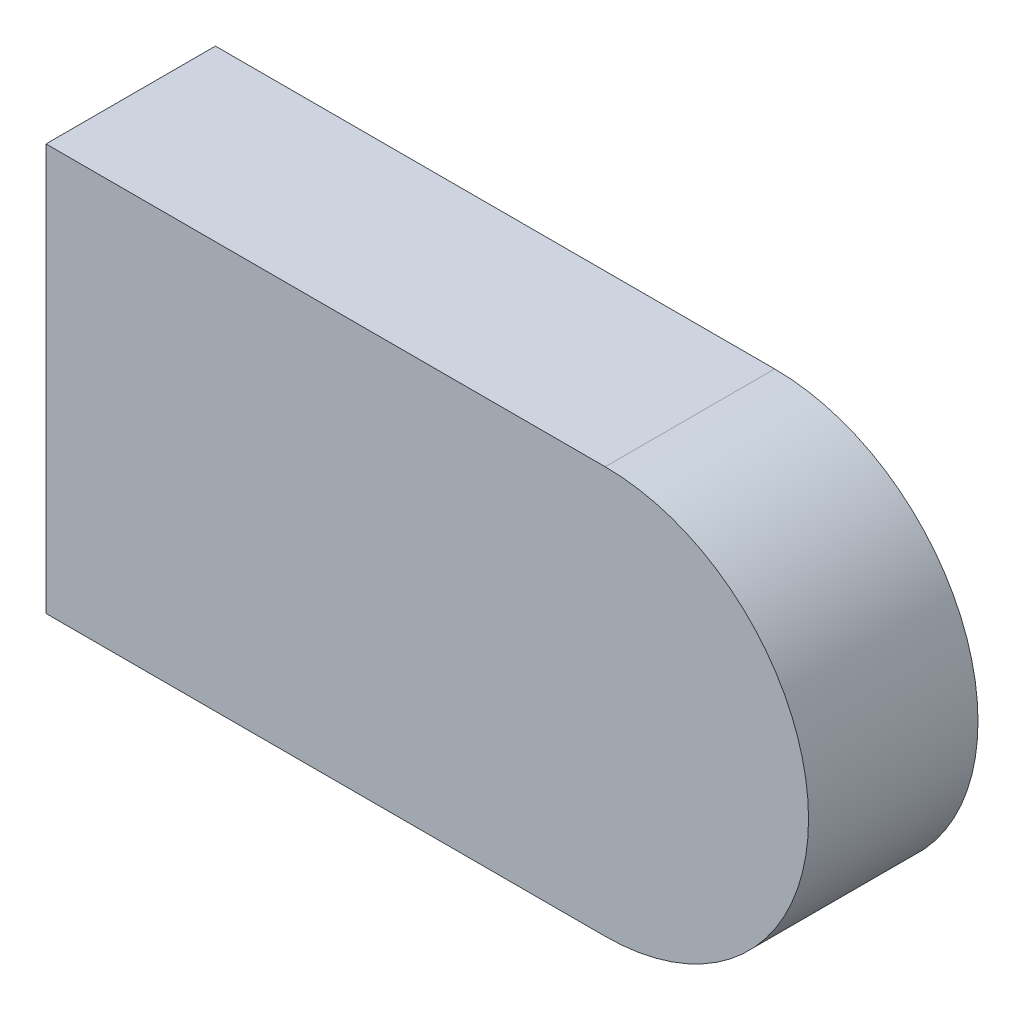
ISO-10303-21;
HEADER;
FILE_DESCRIPTION(('STEP AP214'),'2;1');
FILE_NAME('part.step','',(''),(''),'','','');
FILE_SCHEMA(('AUTOMOTIVE_DESIGN { 1 0 10303 214 1 1 1 1 }'));
ENDSEC;
DATA;
#1=APPLICATION_CONTEXT('core data for automotive mechanical design processes');
#2=APPLICATION_PROTOCOL_DEFINITION('international standard','automotive_design',2000,#1);
#3=PRODUCT_CONTEXT('',#1,'mechanical');
#4=PRODUCT('Part','Part','',(#3));
#5=PRODUCT_RELATED_PRODUCT_CATEGORY('part','',(#4));
#6=PRODUCT_DEFINITION_FORMATION('','',#4);
#7=PRODUCT_DEFINITION_CONTEXT('part definition',#1,'design');
#8=PRODUCT_DEFINITION('design','',#6,#7);
#9=PRODUCT_DEFINITION_SHAPE('','',#8);
#10=(LENGTH_UNIT() NAMED_UNIT(*) SI_UNIT(.MILLI.,.METRE.));
#11=(NAMED_UNIT(*) PLANE_ANGLE_UNIT() SI_UNIT($,.RADIAN.));
#12=(NAMED_UNIT(*) SI_UNIT($,.STERADIAN.) SOLID_ANGLE_UNIT());
#13=UNCERTAINTY_MEASURE_WITH_UNIT(LENGTH_MEASURE(1.E-05),#10,'distance_accuracy_value','');
#14=(GEOMETRIC_REPRESENTATION_CONTEXT(3) GLOBAL_UNCERTAINTY_ASSIGNED_CONTEXT((#13)) GLOBAL_UNIT_ASSIGNED_CONTEXT((#10,
#11,#12)) REPRESENTATION_CONTEXT('',''));
#15=CARTESIAN_POINT('',(0.,0.,0.));
#16=DIRECTION('',(0.,0.,1.));
#17=DIRECTION('',(1.,0.,0.));
#18=AXIS2_PLACEMENT_3D('',#15,#16,#17);
#19=CARTESIAN_POINT('',(-4.05,-1.37,0.));
#20=DIRECTION('',(0.,1.,0.));
#21=DIRECTION('',(1.,0.,0.));
#22=AXIS2_PLACEMENT_3D('',#19,#20,#21);
#23=PLANE('',#22);
#24=DIRECTION('',(1.,0.,0.));
#25=VECTOR('',#24,1.);
#26=CARTESIAN_POINT('',(-4.05,-1.37,0.));
#27=LINE('',#26,#25);
#28=CARTESIAN_POINT('',(-4.05,-1.37,0.));
#29=VERTEX_POINT('',#28);
#30=CARTESIAN_POINT('',(-3.72,-1.37,0.));
#31=VERTEX_POINT('',#30);
#32=EDGE_CURVE('E11',#29,#31,#27,.T.);
#33=ORIENTED_EDGE('',*,*,#32,.T.);
#34=DIRECTION('',(0.,0.,1.));
#35=VECTOR('',#34,1.);
#36=CARTESIAN_POINT('',(-3.72,-1.37,0.));
#37=LINE('',#36,#35);
#38=CARTESIAN_POINT('',(-3.72,-1.37,0.1));
#39=VERTEX_POINT('',#38);
#40=EDGE_CURVE('E24',#31,#39,#37,.T.);
#41=ORIENTED_EDGE('',*,*,#40,.T.);
#42=DIRECTION('',(1.,0.,0.));
#43=VECTOR('',#42,1.);
#44=CARTESIAN_POINT('',(-4.05,-1.37,0.1));
#45=LINE('',#44,#43);
#46=CARTESIAN_POINT('',(-4.05,-1.37,0.1));
#47=VERTEX_POINT('',#46);
#48=EDGE_CURVE('E88',#47,#39,#45,.T.);
#49=ORIENTED_EDGE('',*,*,#48,.F.);
#50=DIRECTION('',(0.,0.,1.));
#51=VECTOR('',#50,1.);
#52=CARTESIAN_POINT('',(-4.05,-1.37,0.));
#53=LINE('',#52,#51);
#54=EDGE_CURVE('E36',#29,#47,#53,.T.);
#55=ORIENTED_EDGE('',*,*,#54,.F.);
#56=EDGE_LOOP('',(#33,#41,#49,#55));
#57=FACE_BOUND('',#56,.T.);
#58=ADVANCED_FACE('F17',(#57),#23,.F.);
#59=CARTESIAN_POINT('',(-3.72,-1.25,0.));
#60=DIRECTION('',(0.,0.,-1.));
#61=DIRECTION('',(1.,0.,0.));
#62=AXIS2_PLACEMENT_3D('',#59,#60,#61);
#63=CYLINDRICAL_SURFACE('',#62,0.12);
#64=CARTESIAN_POINT('',(-3.72,-1.25,0.));
#65=DIRECTION('',(0.,0.,1.));
#66=DIRECTION('',(1.,0.,0.));
#67=AXIS2_PLACEMENT_3D('',#64,#65,#66);
#68=CIRCLE('',#67,0.12);
#69=CARTESIAN_POINT('',(-3.72,-1.13,0.));
#70=VERTEX_POINT('',#69);
#71=EDGE_CURVE('E85',#31,#70,#68,.T.);
#72=ORIENTED_EDGE('',*,*,#71,.T.);
#73=DIRECTION('',(0.,0.,1.));
#74=VECTOR('',#73,1.);
#75=CARTESIAN_POINT('',(-3.72,-1.13,0.));
#76=LINE('',#75,#74);
#77=CARTESIAN_POINT('',(-3.72,-1.13,0.1));
#78=VERTEX_POINT('',#77);
#79=EDGE_CURVE('E73',#70,#78,#76,.T.);
#80=ORIENTED_EDGE('',*,*,#79,.T.);
#81=CARTESIAN_POINT('',(-3.72,-1.25,0.1));
#82=DIRECTION('',(0.,0.,1.));
#83=DIRECTION('',(1.,0.,0.));
#84=AXIS2_PLACEMENT_3D('',#81,#82,#83);
#85=CIRCLE('',#84,0.12);
#86=EDGE_CURVE('E66',#39,#78,#85,.T.);
#87=ORIENTED_EDGE('',*,*,#86,.F.);
#88=ORIENTED_EDGE('',*,*,#40,.F.);
#89=EDGE_LOOP('',(#72,#80,#87,#88));
#90=FACE_BOUND('',#89,.T.);
#91=ADVANCED_FACE('F89',(#90),#63,.T.);
#92=CARTESIAN_POINT('',(-4.05,-1.13,0.));
#93=DIRECTION('',(0.,1.,0.));
#94=DIRECTION('',(1.,0.,0.));
#95=AXIS2_PLACEMENT_3D('',#92,#93,#94);
#96=PLANE('',#95);
#97=DIRECTION('',(0.,0.,1.));
#98=VECTOR('',#97,1.);
#99=CARTESIAN_POINT('',(-4.05,-1.13,0.));
#100=LINE('',#99,#98);
#101=CARTESIAN_POINT('',(-4.05,-1.13,0.));
#102=VERTEX_POINT('',#101);
#103=CARTESIAN_POINT('',(-4.05,-1.13,0.1));
#104=VERTEX_POINT('',#103);
#105=EDGE_CURVE('E56',#102,#104,#100,.T.);
#106=ORIENTED_EDGE('',*,*,#105,.T.);
#107=DIRECTION('',(1.,0.,0.));
#108=VECTOR('',#107,1.);
#109=CARTESIAN_POINT('',(-4.05,-1.13,0.1));
#110=LINE('',#109,#108);
#111=EDGE_CURVE('E67',#104,#78,#110,.T.);
#112=ORIENTED_EDGE('',*,*,#111,.T.);
#113=ORIENTED_EDGE('',*,*,#79,.F.);
#114=DIRECTION('',(1.,0.,0.));
#115=VECTOR('',#114,1.);
#116=CARTESIAN_POINT('',(-4.05,-1.13,0.));
#117=LINE('',#116,#115);
#118=EDGE_CURVE('E71',#102,#70,#117,.T.);
#119=ORIENTED_EDGE('',*,*,#118,.F.);
#120=EDGE_LOOP('',(#106,#112,#113,#119));
#121=FACE_BOUND('',#120,.T.);
#122=ADVANCED_FACE('F72',(#121),#96,.T.);
#123=CARTESIAN_POINT('',(-4.05,-1.37,0.));
#124=DIRECTION('',(-1.,0.,0.));
#125=DIRECTION('',(0.,1.,0.));
#126=AXIS2_PLACEMENT_3D('',#123,#124,#125);
#127=PLANE('',#126);
#128=ORIENTED_EDGE('',*,*,#54,.T.);
#129=DIRECTION('',(0.,1.,0.));
#130=VECTOR('',#129,1.);
#131=CARTESIAN_POINT('',(-4.05,-1.37,0.1));
#132=LINE('',#131,#130);
#133=EDGE_CURVE('E62',#47,#104,#132,.T.);
#134=ORIENTED_EDGE('',*,*,#133,.T.);
#135=ORIENTED_EDGE('',*,*,#105,.F.);
#136=DIRECTION('',(0.,1.,0.));
#137=VECTOR('',#136,1.);
#138=CARTESIAN_POINT('',(-4.05,-1.37,0.));
#139=LINE('',#138,#137);
#140=EDGE_CURVE('E60',#29,#102,#139,.T.);
#141=ORIENTED_EDGE('',*,*,#140,.F.);
#142=EDGE_LOOP('',(#128,#134,#135,#141));
#143=FACE_BOUND('',#142,.T.);
#144=ADVANCED_FACE('F58',(#143),#127,.T.);
#145=CARTESIAN_POINT('',(-3.849490847913,-1.25,0.));
#146=DIRECTION('',(0.,0.,1.));
#147=DIRECTION('',(1.,0.,0.));
#148=AXIS2_PLACEMENT_3D('',#145,#146,#147);
#149=PLANE('',#148);
#150=ORIENTED_EDGE('',*,*,#140,.T.);
#151=ORIENTED_EDGE('',*,*,#118,.T.);
#152=ORIENTED_EDGE('',*,*,#71,.F.);
#153=ORIENTED_EDGE('',*,*,#32,.F.);
#154=EDGE_LOOP('',(#150,#151,#152,#153));
#155=FACE_BOUND('',#154,.T.);
#156=ADVANCED_FACE('F77',(#155),#149,.F.);
#157=CARTESIAN_POINT('',(-3.849490847913,-1.25,0.1));
#158=DIRECTION('',(0.,0.,1.));
#159=DIRECTION('',(1.,0.,0.));
#160=AXIS2_PLACEMENT_3D('',#157,#158,#159);
#161=PLANE('',#160);
#162=ORIENTED_EDGE('',*,*,#48,.T.);
#163=ORIENTED_EDGE('',*,*,#86,.T.);
#164=ORIENTED_EDGE('',*,*,#111,.F.);
#165=ORIENTED_EDGE('',*,*,#133,.F.);
#166=EDGE_LOOP('',(#162,#163,#164,#165));
#167=FACE_BOUND('',#166,.T.);
#168=ADVANCED_FACE('F91',(#167),#161,.T.);
#169=CLOSED_SHELL('',(#58,#91,#122,#144,#156,#168));
#170=MANIFOLD_SOLID_BREP('B1',#169);
#171=ADVANCED_BREP_SHAPE_REPRESENTATION('',(#18,#170),#14);
#172=SHAPE_DEFINITION_REPRESENTATION(#9,#171);
ENDSEC;
END-ISO-10303-21;
